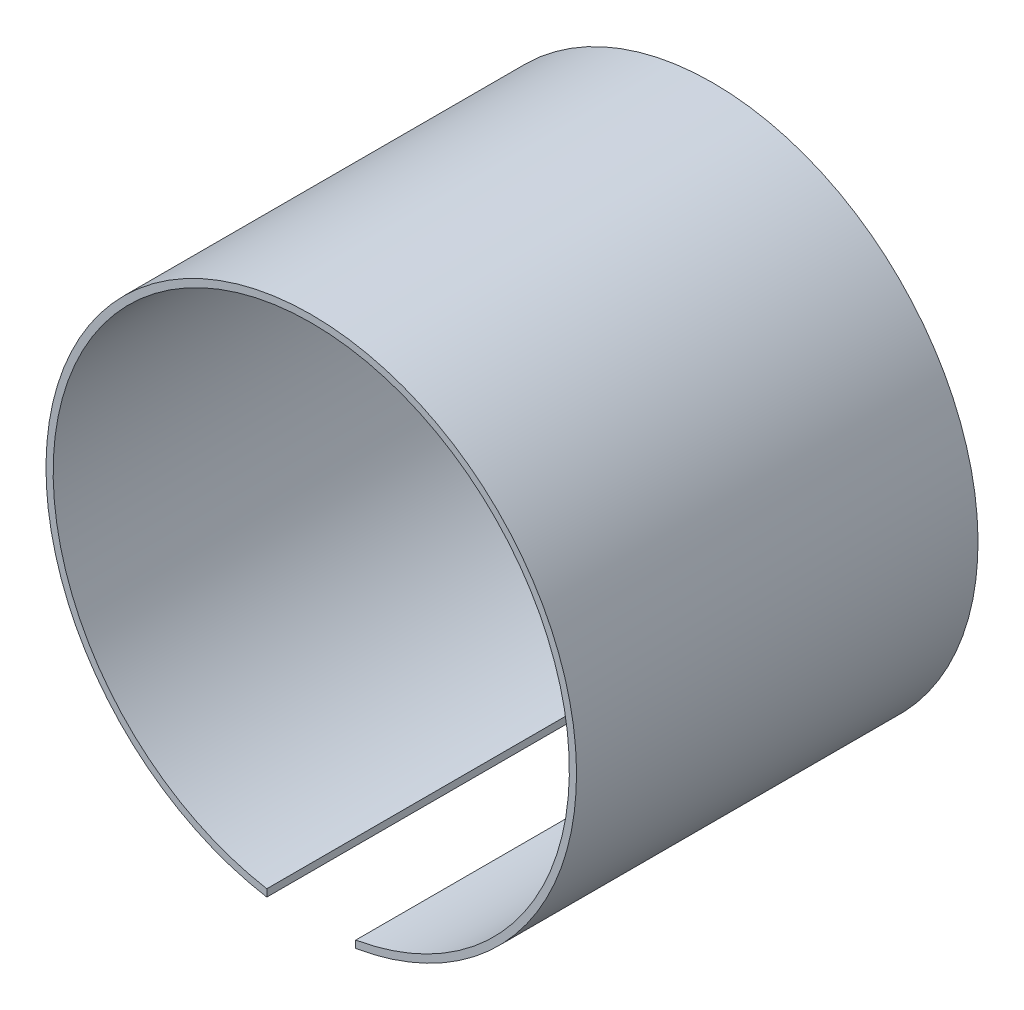
ISO-10303-21;
HEADER;
FILE_DESCRIPTION(('STEP AP214'),'2;1');
FILE_NAME('part.step','',(''),(''),'','','');
FILE_SCHEMA(('AUTOMOTIVE_DESIGN { 1 0 10303 214 1 1 1 1 }'));
ENDSEC;
DATA;
#1=APPLICATION_CONTEXT('core data for automotive mechanical design processes');
#2=APPLICATION_PROTOCOL_DEFINITION('international standard','automotive_design',2000,#1);
#3=PRODUCT_CONTEXT('',#1,'mechanical');
#4=PRODUCT('Part','Part','',(#3));
#5=PRODUCT_RELATED_PRODUCT_CATEGORY('part','',(#4));
#6=PRODUCT_DEFINITION_FORMATION('','',#4);
#7=PRODUCT_DEFINITION_CONTEXT('part definition',#1,'design');
#8=PRODUCT_DEFINITION('design','',#6,#7);
#9=PRODUCT_DEFINITION_SHAPE('','',#8);
#10=(LENGTH_UNIT() NAMED_UNIT(*) SI_UNIT(.MILLI.,.METRE.));
#11=(NAMED_UNIT(*) PLANE_ANGLE_UNIT() SI_UNIT($,.RADIAN.));
#12=(NAMED_UNIT(*) SI_UNIT($,.STERADIAN.) SOLID_ANGLE_UNIT());
#13=UNCERTAINTY_MEASURE_WITH_UNIT(LENGTH_MEASURE(1.E-05),#10,'distance_accuracy_value','');
#14=(GEOMETRIC_REPRESENTATION_CONTEXT(3) GLOBAL_UNCERTAINTY_ASSIGNED_CONTEXT((#13)) GLOBAL_UNIT_ASSIGNED_CONTEXT((#10,
#11,#12)) REPRESENTATION_CONTEXT('',''));
#15=CARTESIAN_POINT('',(0.,0.,0.));
#16=DIRECTION('',(0.,0.,1.));
#17=DIRECTION('',(1.,0.,0.));
#18=AXIS2_PLACEMENT_3D('',#15,#16,#17);
#19=CARTESIAN_POINT('',(0.,0.,28.));
#20=DIRECTION('',(0.,0.,-1.));
#21=DIRECTION('',(-1.,0.,0.));
#22=AXIS2_PLACEMENT_3D('',#19,#20,#21);
#23=CYLINDRICAL_SURFACE('',#22,18.);
#24=CARTESIAN_POINT('',(0.,0.,0.));
#25=DIRECTION('',(0.,0.,-1.));
#26=DIRECTION('',(1.,0.,0.));
#27=AXIS2_PLACEMENT_3D('',#24,#25,#26);
#28=CIRCLE('',#27,18.);
#29=CARTESIAN_POINT('',(-3.1,-17.7310462184272,0.));
#30=VERTEX_POINT('',#29);
#31=CARTESIAN_POINT('',(3.1,-17.7310462184272,0.));
#32=VERTEX_POINT('',#31);
#33=EDGE_CURVE('E97',#30,#32,#28,.T.);
#34=ORIENTED_EDGE('',*,*,#33,.T.);
#35=DIRECTION('',(0.,0.,-1.));
#36=VECTOR('',#35,1.);
#37=CARTESIAN_POINT('',(3.1,-17.7310462184272,28.));
#38=LINE('',#37,#36);
#39=CARTESIAN_POINT('',(3.1,-17.7310462184272,28.));
#40=VERTEX_POINT('',#39);
#41=EDGE_CURVE('E11',#40,#32,#38,.T.);
#42=ORIENTED_EDGE('',*,*,#41,.F.);
#43=CARTESIAN_POINT('',(0.,0.,28.));
#44=DIRECTION('',(0.,0.,-1.));
#45=DIRECTION('',(1.,0.,0.));
#46=AXIS2_PLACEMENT_3D('',#43,#44,#45);
#47=CIRCLE('',#46,18.);
#48=CARTESIAN_POINT('',(-3.1,-17.7310462184272,28.));
#49=VERTEX_POINT('',#48);
#50=EDGE_CURVE('E85',#49,#40,#47,.T.);
#51=ORIENTED_EDGE('',*,*,#50,.F.);
#52=DIRECTION('',(0.,0.,-1.));
#53=VECTOR('',#52,1.);
#54=CARTESIAN_POINT('',(-3.1,-17.7310462184272,28.));
#55=LINE('',#54,#53);
#56=EDGE_CURVE('E93',#49,#30,#55,.T.);
#57=ORIENTED_EDGE('',*,*,#56,.T.);
#58=EDGE_LOOP('',(#34,#42,#51,#57));
#59=FACE_BOUND('',#58,.T.);
#60=ADVANCED_FACE('F34',(#59),#23,.F.);
#61=CARTESIAN_POINT('',(3.1,-17.7310462184272,28.));
#62=DIRECTION('',(1.,0.,0.));
#63=DIRECTION('',(0.,0.,-1.));
#64=AXIS2_PLACEMENT_3D('',#61,#62,#63);
#65=PLANE('',#64);
#66=DIRECTION('',(0.,-1.,0.));
#67=VECTOR('',#66,1.);
#68=CARTESIAN_POINT('',(3.1,-17.7310462184272,0.));
#69=LINE('',#68,#67);
#70=CARTESIAN_POINT('',(3.1,-18.2384209842848,0.));
#71=VERTEX_POINT('',#70);
#72=EDGE_CURVE('E89',#32,#71,#69,.T.);
#73=ORIENTED_EDGE('',*,*,#72,.T.);
#74=DIRECTION('',(0.,0.,-1.));
#75=VECTOR('',#74,1.);
#76=CARTESIAN_POINT('',(3.1,-18.2384209842848,28.));
#77=LINE('',#76,#75);
#78=CARTESIAN_POINT('',(3.1,-18.2384209842848,28.));
#79=VERTEX_POINT('',#78);
#80=EDGE_CURVE('E42',#79,#71,#77,.T.);
#81=ORIENTED_EDGE('',*,*,#80,.F.);
#82=DIRECTION('',(0.,-1.,0.));
#83=VECTOR('',#82,1.);
#84=CARTESIAN_POINT('',(3.1,-17.7310462184272,28.));
#85=LINE('',#84,#83);
#86=EDGE_CURVE('E80',#40,#79,#85,.T.);
#87=ORIENTED_EDGE('',*,*,#86,.F.);
#88=ORIENTED_EDGE('',*,*,#41,.T.);
#89=EDGE_LOOP('',(#73,#81,#87,#88));
#90=FACE_BOUND('',#89,.T.);
#91=ADVANCED_FACE('F88',(#90),#65,.F.);
#92=CARTESIAN_POINT('',(0.,0.,28.));
#93=DIRECTION('',(0.,0.,-1.));
#94=DIRECTION('',(-1.,0.,0.));
#95=AXIS2_PLACEMENT_3D('',#92,#93,#94);
#96=CYLINDRICAL_SURFACE('',#95,18.5);
#97=CARTESIAN_POINT('',(0.,0.,0.));
#98=DIRECTION('',(0.,0.,1.));
#99=DIRECTION('',(1.,0.,0.));
#100=AXIS2_PLACEMENT_3D('',#97,#98,#99);
#101=CIRCLE('',#100,18.5);
#102=CARTESIAN_POINT('',(-3.1,-18.2384209842848,0.));
#103=VERTEX_POINT('',#102);
#104=EDGE_CURVE('E67',#71,#103,#101,.T.);
#105=ORIENTED_EDGE('',*,*,#104,.T.);
#106=DIRECTION('',(0.,0.,-1.));
#107=VECTOR('',#106,1.);
#108=CARTESIAN_POINT('',(-3.1,-18.2384209842848,28.));
#109=LINE('',#108,#107);
#110=CARTESIAN_POINT('',(-3.1,-18.2384209842848,28.));
#111=VERTEX_POINT('',#110);
#112=EDGE_CURVE('E90',#111,#103,#109,.T.);
#113=ORIENTED_EDGE('',*,*,#112,.F.);
#114=CARTESIAN_POINT('',(0.,0.,28.));
#115=DIRECTION('',(0.,0.,1.));
#116=DIRECTION('',(1.,0.,0.));
#117=AXIS2_PLACEMENT_3D('',#114,#115,#116);
#118=CIRCLE('',#117,18.5);
#119=EDGE_CURVE('E83',#79,#111,#118,.T.);
#120=ORIENTED_EDGE('',*,*,#119,.F.);
#121=ORIENTED_EDGE('',*,*,#80,.T.);
#122=EDGE_LOOP('',(#105,#113,#120,#121));
#123=FACE_BOUND('',#122,.T.);
#124=ADVANCED_FACE('F91',(#123),#96,.T.);
#125=CARTESIAN_POINT('',(-3.1,-17.7310462184272,28.));
#126=DIRECTION('',(-1.,0.,0.));
#127=DIRECTION('',(0.,0.,1.));
#128=AXIS2_PLACEMENT_3D('',#125,#126,#127);
#129=PLANE('',#128);
#130=DIRECTION('',(0.,1.,0.));
#131=VECTOR('',#130,1.);
#132=CARTESIAN_POINT('',(-3.1,-17.7310462184272,0.));
#133=LINE('',#132,#131);
#134=EDGE_CURVE('E73',#103,#30,#133,.T.);
#135=ORIENTED_EDGE('',*,*,#134,.T.);
#136=ORIENTED_EDGE('',*,*,#56,.F.);
#137=DIRECTION('',(0.,1.,0.));
#138=VECTOR('',#137,1.);
#139=CARTESIAN_POINT('',(-3.1,-17.7310462184272,28.));
#140=LINE('',#139,#138);
#141=EDGE_CURVE('E50',#111,#49,#140,.T.);
#142=ORIENTED_EDGE('',*,*,#141,.F.);
#143=ORIENTED_EDGE('',*,*,#112,.T.);
#144=EDGE_LOOP('',(#135,#136,#142,#143));
#145=FACE_BOUND('',#144,.T.);
#146=ADVANCED_FACE('F104',(#145),#129,.F.);
#147=CARTESIAN_POINT('',(0.,0.,28.));
#148=DIRECTION('',(0.,0.,1.));
#149=DIRECTION('',(1.,0.,0.));
#150=AXIS2_PLACEMENT_3D('',#147,#148,#149);
#151=PLANE('',#150);
#152=ORIENTED_EDGE('',*,*,#50,.T.);
#153=ORIENTED_EDGE('',*,*,#86,.T.);
#154=ORIENTED_EDGE('',*,*,#119,.T.);
#155=ORIENTED_EDGE('',*,*,#141,.T.);
#156=EDGE_LOOP('',(#152,#153,#154,#155));
#157=FACE_BOUND('',#156,.T.);
#158=ADVANCED_FACE('F81',(#157),#151,.T.);
#159=CARTESIAN_POINT('',(0.,0.,0.));
#160=DIRECTION('',(0.,0.,1.));
#161=DIRECTION('',(1.,0.,0.));
#162=AXIS2_PLACEMENT_3D('',#159,#160,#161);
#163=PLANE('',#162);
#164=ORIENTED_EDGE('',*,*,#33,.F.);
#165=ORIENTED_EDGE('',*,*,#134,.F.);
#166=ORIENTED_EDGE('',*,*,#104,.F.);
#167=ORIENTED_EDGE('',*,*,#72,.F.);
#168=EDGE_LOOP('',(#164,#165,#166,#167));
#169=FACE_BOUND('',#168,.T.);
#170=ADVANCED_FACE('F107',(#169),#163,.F.);
#171=CLOSED_SHELL('',(#60,#91,#124,#146,#158,#170));
#172=MANIFOLD_SOLID_BREP('B2',#171);
#173=ADVANCED_BREP_SHAPE_REPRESENTATION('',(#18,#172),#14);
#174=SHAPE_DEFINITION_REPRESENTATION(#9,#173);
ENDSEC;
END-ISO-10303-21;
